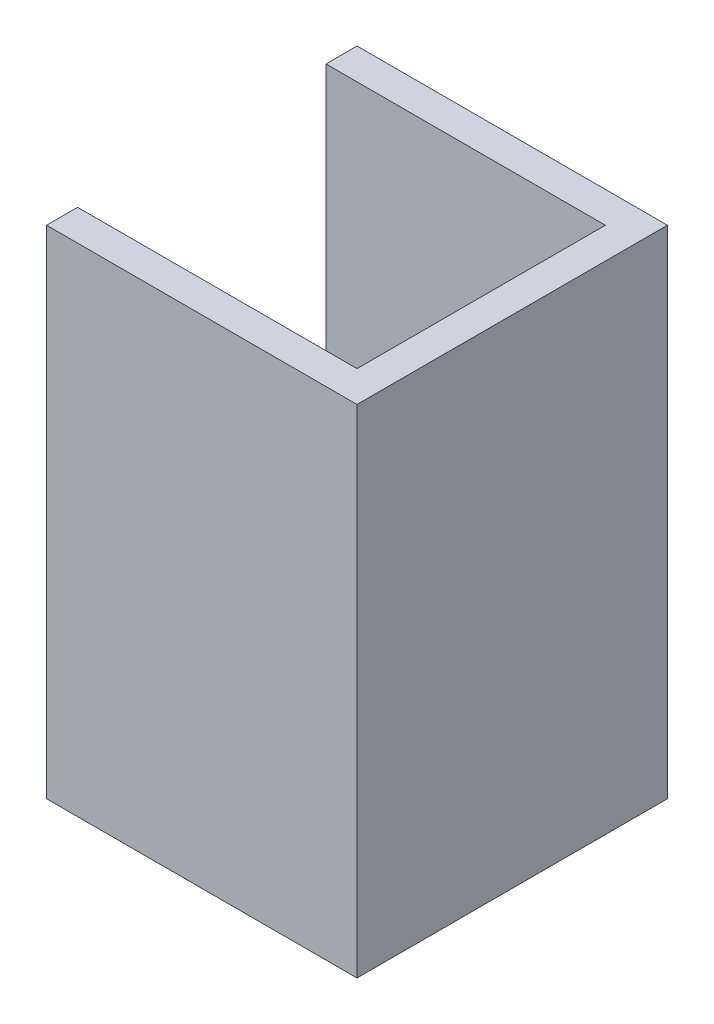
ISO-10303-21;
HEADER;
FILE_DESCRIPTION(('STEP AP214'),'2;1');
FILE_NAME('part.step','',(''),(''),'','','');
FILE_SCHEMA(('AUTOMOTIVE_DESIGN { 1 0 10303 214 1 1 1 1 }'));
ENDSEC;
DATA;
#1=APPLICATION_CONTEXT('core data for automotive mechanical design processes');
#2=APPLICATION_PROTOCOL_DEFINITION('international standard','automotive_design',2000,#1);
#3=PRODUCT_CONTEXT('',#1,'mechanical');
#4=PRODUCT('Part','Part','',(#3));
#5=PRODUCT_RELATED_PRODUCT_CATEGORY('part','',(#4));
#6=PRODUCT_DEFINITION_FORMATION('','',#4);
#7=PRODUCT_DEFINITION_CONTEXT('part definition',#1,'design');
#8=PRODUCT_DEFINITION('design','',#6,#7);
#9=PRODUCT_DEFINITION_SHAPE('','',#8);
#10=(LENGTH_UNIT() NAMED_UNIT(*) SI_UNIT(.MILLI.,.METRE.));
#11=(NAMED_UNIT(*) PLANE_ANGLE_UNIT() SI_UNIT($,.RADIAN.));
#12=(NAMED_UNIT(*) SI_UNIT($,.STERADIAN.) SOLID_ANGLE_UNIT());
#13=UNCERTAINTY_MEASURE_WITH_UNIT(LENGTH_MEASURE(1.E-05),#10,'distance_accuracy_value','');
#14=(GEOMETRIC_REPRESENTATION_CONTEXT(3) GLOBAL_UNCERTAINTY_ASSIGNED_CONTEXT((#13)) GLOBAL_UNIT_ASSIGNED_CONTEXT((#10,
#11,#12)) REPRESENTATION_CONTEXT('',''));
#15=CARTESIAN_POINT('',(0.,0.,0.));
#16=DIRECTION('',(0.,0.,1.));
#17=DIRECTION('',(1.,0.,0.));
#18=AXIS2_PLACEMENT_3D('',#15,#16,#17);
#19=CARTESIAN_POINT('',(12.5,40.,-12.5));
#20=DIRECTION('',(0.,0.,1.));
#21=DIRECTION('',(1.,0.,0.));
#22=AXIS2_PLACEMENT_3D('',#19,#20,#21);
#23=PLANE('',#22);
#24=DIRECTION('',(-1.,0.,0.));
#25=VECTOR('',#24,1.);
#26=CARTESIAN_POINT('',(12.5,0.,-12.5));
#27=LINE('',#26,#25);
#28=CARTESIAN_POINT('',(12.5,0.,-12.5));
#29=VERTEX_POINT('',#28);
#30=CARTESIAN_POINT('',(-12.5,0.,-12.5));
#31=VERTEX_POINT('',#30);
#32=EDGE_CURVE('E131',#29,#31,#27,.T.);
#33=ORIENTED_EDGE('',*,*,#32,.T.);
#34=DIRECTION('',(0.,-1.,0.));
#35=VECTOR('',#34,1.);
#36=CARTESIAN_POINT('',(-12.5,40.,-12.5));
#37=LINE('',#36,#35);
#38=CARTESIAN_POINT('',(-12.5,40.,-12.5));
#39=VERTEX_POINT('',#38);
#40=EDGE_CURVE('E11',#39,#31,#37,.T.);
#41=ORIENTED_EDGE('',*,*,#40,.F.);
#42=DIRECTION('',(-1.,0.,0.));
#43=VECTOR('',#42,1.);
#44=CARTESIAN_POINT('',(12.5,40.,-12.5));
#45=LINE('',#44,#43);
#46=CARTESIAN_POINT('',(12.5,40.,-12.5));
#47=VERTEX_POINT('',#46);
#48=EDGE_CURVE('E145',#47,#39,#45,.T.);
#49=ORIENTED_EDGE('',*,*,#48,.F.);
#50=DIRECTION('',(0.,-1.,0.));
#51=VECTOR('',#50,1.);
#52=CARTESIAN_POINT('',(12.5,40.,-12.5));
#53=LINE('',#52,#51);
#54=EDGE_CURVE('E127',#47,#29,#53,.T.);
#55=ORIENTED_EDGE('',*,*,#54,.T.);
#56=EDGE_LOOP('',(#33,#41,#49,#55));
#57=FACE_BOUND('',#56,.T.);
#58=ADVANCED_FACE('F35',(#57),#23,.F.);
#59=CARTESIAN_POINT('',(-12.5,40.,-10.));
#60=DIRECTION('',(1.,0.,0.));
#61=DIRECTION('',(0.,0.,-1.));
#62=AXIS2_PLACEMENT_3D('',#59,#60,#61);
#63=PLANE('',#62);
#64=DIRECTION('',(0.,0.,1.));
#65=VECTOR('',#64,1.);
#66=CARTESIAN_POINT('',(-12.5,0.,-10.));
#67=LINE('',#66,#65);
#68=CARTESIAN_POINT('',(-12.5,0.,-10.));
#69=VERTEX_POINT('',#68);
#70=EDGE_CURVE('E134',#31,#69,#67,.T.);
#71=ORIENTED_EDGE('',*,*,#70,.T.);
#72=DIRECTION('',(0.,-1.,0.));
#73=VECTOR('',#72,1.);
#74=CARTESIAN_POINT('',(-12.5,40.,-10.));
#75=LINE('',#74,#73);
#76=CARTESIAN_POINT('',(-12.5,40.,-10.));
#77=VERTEX_POINT('',#76);
#78=EDGE_CURVE('E43',#77,#69,#75,.T.);
#79=ORIENTED_EDGE('',*,*,#78,.F.);
#80=DIRECTION('',(0.,0.,1.));
#81=VECTOR('',#80,1.);
#82=CARTESIAN_POINT('',(-12.5,40.,-10.));
#83=LINE('',#82,#81);
#84=EDGE_CURVE('E94',#39,#77,#83,.T.);
#85=ORIENTED_EDGE('',*,*,#84,.F.);
#86=ORIENTED_EDGE('',*,*,#40,.T.);
#87=EDGE_LOOP('',(#71,#79,#85,#86));
#88=FACE_BOUND('',#87,.T.);
#89=ADVANCED_FACE('F180',(#88),#63,.F.);
#90=CARTESIAN_POINT('',(10.,40.,-10.));
#91=DIRECTION('',(0.,0.,-1.));
#92=DIRECTION('',(-1.,0.,0.));
#93=AXIS2_PLACEMENT_3D('',#90,#91,#92);
#94=PLANE('',#93);
#95=DIRECTION('',(1.,0.,0.));
#96=VECTOR('',#95,1.);
#97=CARTESIAN_POINT('',(10.,0.,-10.));
#98=LINE('',#97,#96);
#99=CARTESIAN_POINT('',(10.,0.,-10.));
#100=VERTEX_POINT('',#99);
#101=EDGE_CURVE('E136',#69,#100,#98,.T.);
#102=ORIENTED_EDGE('',*,*,#101,.T.);
#103=DIRECTION('',(0.,-1.,0.));
#104=VECTOR('',#103,1.);
#105=CARTESIAN_POINT('',(10.,40.,-10.));
#106=LINE('',#105,#104);
#107=CARTESIAN_POINT('',(10.,40.,-10.));
#108=VERTEX_POINT('',#107);
#109=EDGE_CURVE('E152',#108,#100,#106,.T.);
#110=ORIENTED_EDGE('',*,*,#109,.F.);
#111=DIRECTION('',(1.,0.,0.));
#112=VECTOR('',#111,1.);
#113=CARTESIAN_POINT('',(10.,40.,-10.));
#114=LINE('',#113,#112);
#115=EDGE_CURVE('E160',#77,#108,#114,.T.);
#116=ORIENTED_EDGE('',*,*,#115,.F.);
#117=ORIENTED_EDGE('',*,*,#78,.T.);
#118=EDGE_LOOP('',(#102,#110,#116,#117));
#119=FACE_BOUND('',#118,.T.);
#120=ADVANCED_FACE('F158',(#119),#94,.F.);
#121=CARTESIAN_POINT('',(10.,40.,10.));
#122=DIRECTION('',(1.,0.,0.));
#123=DIRECTION('',(0.,0.,-1.));
#124=AXIS2_PLACEMENT_3D('',#121,#122,#123);
#125=PLANE('',#124);
#126=DIRECTION('',(0.,0.,1.));
#127=VECTOR('',#126,1.);
#128=CARTESIAN_POINT('',(10.,0.,10.));
#129=LINE('',#128,#127);
#130=CARTESIAN_POINT('',(10.,0.,10.));
#131=VERTEX_POINT('',#130);
#132=EDGE_CURVE('E138',#100,#131,#129,.T.);
#133=ORIENTED_EDGE('',*,*,#132,.T.);
#134=DIRECTION('',(0.,-1.,0.));
#135=VECTOR('',#134,1.);
#136=CARTESIAN_POINT('',(10.,40.,10.));
#137=LINE('',#136,#135);
#138=CARTESIAN_POINT('',(10.,40.,10.));
#139=VERTEX_POINT('',#138);
#140=EDGE_CURVE('E149',#139,#131,#137,.T.);
#141=ORIENTED_EDGE('',*,*,#140,.F.);
#142=DIRECTION('',(0.,0.,1.));
#143=VECTOR('',#142,1.);
#144=CARTESIAN_POINT('',(10.,40.,10.));
#145=LINE('',#144,#143);
#146=EDGE_CURVE('E172',#108,#139,#145,.T.);
#147=ORIENTED_EDGE('',*,*,#146,.F.);
#148=ORIENTED_EDGE('',*,*,#109,.T.);
#149=EDGE_LOOP('',(#133,#141,#147,#148));
#150=FACE_BOUND('',#149,.T.);
#151=ADVANCED_FACE('F168',(#150),#125,.F.);
#152=CARTESIAN_POINT('',(10.,40.,10.));
#153=DIRECTION('',(0.,0.,1.));
#154=DIRECTION('',(1.,0.,0.));
#155=AXIS2_PLACEMENT_3D('',#152,#153,#154);
#156=PLANE('',#155);
#157=DIRECTION('',(-1.,0.,0.));
#158=VECTOR('',#157,1.);
#159=CARTESIAN_POINT('',(10.,0.,10.));
#160=LINE('',#159,#158);
#161=CARTESIAN_POINT('',(-12.5,0.,10.));
#162=VERTEX_POINT('',#161);
#163=EDGE_CURVE('E140',#131,#162,#160,.T.);
#164=ORIENTED_EDGE('',*,*,#163,.T.);
#165=DIRECTION('',(0.,-1.,0.));
#166=VECTOR('',#165,1.);
#167=CARTESIAN_POINT('',(-12.5,40.,10.));
#168=LINE('',#167,#166);
#169=CARTESIAN_POINT('',(-12.5,40.,10.));
#170=VERTEX_POINT('',#169);
#171=EDGE_CURVE('E122',#170,#162,#168,.T.);
#172=ORIENTED_EDGE('',*,*,#171,.F.);
#173=DIRECTION('',(-1.,0.,0.));
#174=VECTOR('',#173,1.);
#175=CARTESIAN_POINT('',(10.,40.,10.));
#176=LINE('',#175,#174);
#177=EDGE_CURVE('E113',#139,#170,#176,.T.);
#178=ORIENTED_EDGE('',*,*,#177,.F.);
#179=ORIENTED_EDGE('',*,*,#140,.T.);
#180=EDGE_LOOP('',(#164,#172,#178,#179));
#181=FACE_BOUND('',#180,.T.);
#182=ADVANCED_FACE('F171',(#181),#156,.F.);
#183=CARTESIAN_POINT('',(-12.5,40.,12.5));
#184=DIRECTION('',(1.,0.,0.));
#185=DIRECTION('',(0.,0.,-1.));
#186=AXIS2_PLACEMENT_3D('',#183,#184,#185);
#187=PLANE('',#186);
#188=DIRECTION('',(0.,0.,1.));
#189=VECTOR('',#188,1.);
#190=CARTESIAN_POINT('',(-12.5,0.,12.5));
#191=LINE('',#190,#189);
#192=CARTESIAN_POINT('',(-12.5,0.,12.5));
#193=VERTEX_POINT('',#192);
#194=EDGE_CURVE('E121',#162,#193,#191,.T.);
#195=ORIENTED_EDGE('',*,*,#194,.T.);
#196=DIRECTION('',(0.,-1.,0.));
#197=VECTOR('',#196,1.);
#198=CARTESIAN_POINT('',(-12.5,40.,12.5));
#199=LINE('',#198,#197);
#200=CARTESIAN_POINT('',(-12.5,40.,12.5));
#201=VERTEX_POINT('',#200);
#202=EDGE_CURVE('E118',#201,#193,#199,.T.);
#203=ORIENTED_EDGE('',*,*,#202,.F.);
#204=DIRECTION('',(0.,0.,1.));
#205=VECTOR('',#204,1.);
#206=CARTESIAN_POINT('',(-12.5,40.,12.5));
#207=LINE('',#206,#205);
#208=EDGE_CURVE('E107',#170,#201,#207,.T.);
#209=ORIENTED_EDGE('',*,*,#208,.F.);
#210=ORIENTED_EDGE('',*,*,#171,.T.);
#211=EDGE_LOOP('',(#195,#203,#209,#210));
#212=FACE_BOUND('',#211,.T.);
#213=ADVANCED_FACE('F119',(#212),#187,.F.);
#214=CARTESIAN_POINT('',(12.5,40.,12.5));
#215=DIRECTION('',(0.,0.,-1.));
#216=DIRECTION('',(-1.,0.,0.));
#217=AXIS2_PLACEMENT_3D('',#214,#215,#216);
#218=PLANE('',#217);
#219=DIRECTION('',(1.,0.,0.));
#220=VECTOR('',#219,1.);
#221=CARTESIAN_POINT('',(12.5,0.,12.5));
#222=LINE('',#221,#220);
#223=CARTESIAN_POINT('',(12.5,0.,12.5));
#224=VERTEX_POINT('',#223);
#225=EDGE_CURVE('E80',#193,#224,#222,.T.);
#226=ORIENTED_EDGE('',*,*,#225,.T.);
#227=DIRECTION('',(0.,-1.,0.));
#228=VECTOR('',#227,1.);
#229=CARTESIAN_POINT('',(12.5,40.,12.5));
#230=LINE('',#229,#228);
#231=CARTESIAN_POINT('',(12.5,40.,12.5));
#232=VERTEX_POINT('',#231);
#233=EDGE_CURVE('E123',#232,#224,#230,.T.);
#234=ORIENTED_EDGE('',*,*,#233,.F.);
#235=DIRECTION('',(1.,0.,0.));
#236=VECTOR('',#235,1.);
#237=CARTESIAN_POINT('',(12.5,40.,12.5));
#238=LINE('',#237,#236);
#239=EDGE_CURVE('E111',#201,#232,#238,.T.);
#240=ORIENTED_EDGE('',*,*,#239,.F.);
#241=ORIENTED_EDGE('',*,*,#202,.T.);
#242=EDGE_LOOP('',(#226,#234,#240,#241));
#243=FACE_BOUND('',#242,.T.);
#244=ADVANCED_FACE('F125',(#243),#218,.F.);
#245=CARTESIAN_POINT('',(12.5,40.,12.5));
#246=DIRECTION('',(-1.,0.,0.));
#247=DIRECTION('',(0.,0.,1.));
#248=AXIS2_PLACEMENT_3D('',#245,#246,#247);
#249=PLANE('',#248);
#250=DIRECTION('',(0.,0.,-1.));
#251=VECTOR('',#250,1.);
#252=CARTESIAN_POINT('',(12.5,0.,12.5));
#253=LINE('',#252,#251);
#254=EDGE_CURVE('E86',#224,#29,#253,.T.);
#255=ORIENTED_EDGE('',*,*,#254,.T.);
#256=ORIENTED_EDGE('',*,*,#54,.F.);
#257=DIRECTION('',(0.,0.,-1.));
#258=VECTOR('',#257,1.);
#259=CARTESIAN_POINT('',(12.5,40.,12.5));
#260=LINE('',#259,#258);
#261=EDGE_CURVE('E51',#232,#47,#260,.T.);
#262=ORIENTED_EDGE('',*,*,#261,.F.);
#263=ORIENTED_EDGE('',*,*,#233,.T.);
#264=EDGE_LOOP('',(#255,#256,#262,#263));
#265=FACE_BOUND('',#264,.T.);
#266=ADVANCED_FACE('F196',(#265),#249,.F.);
#267=CARTESIAN_POINT('',(0.,40.,0.));
#268=DIRECTION('',(0.,-1.,0.));
#269=DIRECTION('',(0.,0.,-1.));
#270=AXIS2_PLACEMENT_3D('',#267,#268,#269);
#271=PLANE('',#270);
#272=ORIENTED_EDGE('',*,*,#48,.T.);
#273=ORIENTED_EDGE('',*,*,#84,.T.);
#274=ORIENTED_EDGE('',*,*,#115,.T.);
#275=ORIENTED_EDGE('',*,*,#146,.T.);
#276=ORIENTED_EDGE('',*,*,#177,.T.);
#277=ORIENTED_EDGE('',*,*,#208,.T.);
#278=ORIENTED_EDGE('',*,*,#239,.T.);
#279=ORIENTED_EDGE('',*,*,#261,.T.);
#280=EDGE_LOOP('',(#272,#273,#274,#275,#276,#277,#278,#279));
#281=FACE_BOUND('',#280,.T.);
#282=ADVANCED_FACE('F109',(#281),#271,.F.);
#283=CARTESIAN_POINT('',(0.,0.,0.));
#284=DIRECTION('',(0.,-1.,0.));
#285=DIRECTION('',(0.,0.,-1.));
#286=AXIS2_PLACEMENT_3D('',#283,#284,#285);
#287=PLANE('',#286);
#288=ORIENTED_EDGE('',*,*,#32,.F.);
#289=ORIENTED_EDGE('',*,*,#254,.F.);
#290=ORIENTED_EDGE('',*,*,#225,.F.);
#291=ORIENTED_EDGE('',*,*,#194,.F.);
#292=ORIENTED_EDGE('',*,*,#163,.F.);
#293=ORIENTED_EDGE('',*,*,#132,.F.);
#294=ORIENTED_EDGE('',*,*,#101,.F.);
#295=ORIENTED_EDGE('',*,*,#70,.F.);
#296=EDGE_LOOP('',(#288,#289,#290,#291,#292,#293,#294,#295));
#297=FACE_BOUND('',#296,.T.);
#298=ADVANCED_FACE('F164',(#297),#287,.T.);
#299=CLOSED_SHELL('',(#58,#89,#120,#151,#182,#213,#244,#266,#282,#298));
#300=MANIFOLD_SOLID_BREP('B2',#299);
#301=ADVANCED_BREP_SHAPE_REPRESENTATION('',(#18,#300),#14);
#302=SHAPE_DEFINITION_REPRESENTATION(#9,#301);
ENDSEC;
END-ISO-10303-21;
